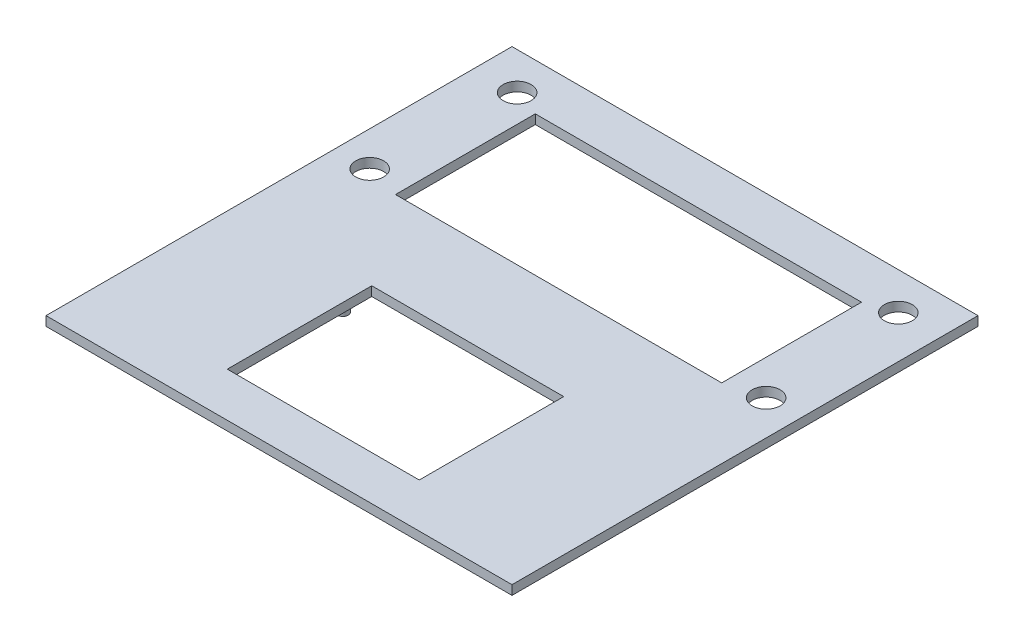
ISO-10303-21;
HEADER;
FILE_DESCRIPTION(('STEP AP214'),'2;1');
FILE_NAME('part.step','',(''),(''),'','','');
FILE_SCHEMA(('AUTOMOTIVE_DESIGN { 1 0 10303 214 1 1 1 1 }'));
ENDSEC;
DATA;
#1=APPLICATION_CONTEXT('core data for automotive mechanical design processes');
#2=APPLICATION_PROTOCOL_DEFINITION('international standard','automotive_design',2000,#1);
#3=PRODUCT_CONTEXT('',#1,'mechanical');
#4=PRODUCT('Part','Part','',(#3));
#5=PRODUCT_RELATED_PRODUCT_CATEGORY('part','',(#4));
#6=PRODUCT_DEFINITION_FORMATION('','',#4);
#7=PRODUCT_DEFINITION_CONTEXT('part definition',#1,'design');
#8=PRODUCT_DEFINITION('design','',#6,#7);
#9=PRODUCT_DEFINITION_SHAPE('','',#8);
#10=(LENGTH_UNIT() NAMED_UNIT(*) SI_UNIT(.MILLI.,.METRE.));
#11=(NAMED_UNIT(*) PLANE_ANGLE_UNIT() SI_UNIT($,.RADIAN.));
#12=(NAMED_UNIT(*) SI_UNIT($,.STERADIAN.) SOLID_ANGLE_UNIT());
#13=UNCERTAINTY_MEASURE_WITH_UNIT(LENGTH_MEASURE(1.E-05),#10,'distance_accuracy_value','');
#14=(GEOMETRIC_REPRESENTATION_CONTEXT(3) GLOBAL_UNCERTAINTY_ASSIGNED_CONTEXT((#13)) GLOBAL_UNIT_ASSIGNED_CONTEXT((#10,
#11,#12)) REPRESENTATION_CONTEXT('',''));
#15=CARTESIAN_POINT('',(0.,0.,0.));
#16=DIRECTION('',(0.,0.,1.));
#17=DIRECTION('',(1.,0.,0.));
#18=AXIS2_PLACEMENT_3D('',#15,#16,#17);
#19=CARTESIAN_POINT('',(0.,1.27,0.));
#20=DIRECTION('',(0.,1.,0.));
#21=DIRECTION('',(0.,0.,1.));
#22=AXIS2_PLACEMENT_3D('',#19,#20,#21);
#23=PLANE('',#22);
#24=DIRECTION('',(0.,0.,1.));
#25=VECTOR('',#24,1.);
#26=CARTESIAN_POINT('',(-13.081,1.27,25.7175));
#27=LINE('',#26,#25);
#28=CARTESIAN_POINT('',(-13.081,1.27,6.0325));
#29=VERTEX_POINT('',#28);
#30=CARTESIAN_POINT('',(-13.081,1.27,25.7175));
#31=VERTEX_POINT('',#30);
#32=EDGE_CURVE('E52',#29,#31,#27,.T.);
#33=ORIENTED_EDGE('',*,*,#32,.F.);
#34=DIRECTION('',(-1.,0.,0.));
#35=VECTOR('',#34,1.);
#36=CARTESIAN_POINT('',(13.081,1.27,6.03249999999999));
#37=LINE('',#36,#35);
#38=CARTESIAN_POINT('',(13.081,1.27,6.03249999999999));
#39=VERTEX_POINT('',#38);
#40=EDGE_CURVE('E134',#39,#29,#37,.T.);
#41=ORIENTED_EDGE('',*,*,#40,.F.);
#42=DIRECTION('',(0.,0.,-1.));
#43=VECTOR('',#42,1.);
#44=CARTESIAN_POINT('',(13.081,1.27,25.7175));
#45=LINE('',#44,#43);
#46=CARTESIAN_POINT('',(13.081,1.27,25.7175));
#47=VERTEX_POINT('',#46);
#48=EDGE_CURVE('E154',#47,#39,#45,.T.);
#49=ORIENTED_EDGE('',*,*,#48,.F.);
#50=DIRECTION('',(1.,0.,0.));
#51=VECTOR('',#50,1.);
#52=CARTESIAN_POINT('',(13.081,1.27,25.7175));
#53=LINE('',#52,#51);
#54=EDGE_CURVE('E148',#31,#47,#53,.T.);
#55=ORIENTED_EDGE('',*,*,#54,.F.);
#56=EDGE_LOOP('',(#33,#41,#49,#55));
#57=FACE_BOUND('',#56,.T.);
#58=DIRECTION('',(0.,0.,1.));
#59=VECTOR('',#58,1.);
#60=CARTESIAN_POINT('',(-22.225,1.27,-6.35));
#61=LINE('',#60,#59);
#62=CARTESIAN_POINT('',(-22.225,1.27,-25.4));
#63=VERTEX_POINT('',#62);
#64=CARTESIAN_POINT('',(-22.225,1.27,-6.35));
#65=VERTEX_POINT('',#64);
#66=EDGE_CURVE('E183',#63,#65,#61,.T.);
#67=ORIENTED_EDGE('',*,*,#66,.F.);
#68=DIRECTION('',(-1.,0.,0.));
#69=VECTOR('',#68,1.);
#70=CARTESIAN_POINT('',(22.225,1.27,-25.4));
#71=LINE('',#70,#69);
#72=CARTESIAN_POINT('',(22.225,1.27,-25.4));
#73=VERTEX_POINT('',#72);
#74=EDGE_CURVE('E173',#73,#63,#71,.T.);
#75=ORIENTED_EDGE('',*,*,#74,.F.);
#76=DIRECTION('',(0.,0.,-1.));
#77=VECTOR('',#76,1.);
#78=CARTESIAN_POINT('',(22.225,1.27,-6.35000000000001));
#79=LINE('',#78,#77);
#80=CARTESIAN_POINT('',(22.225,1.27,-6.35000000000001));
#81=VERTEX_POINT('',#80);
#82=EDGE_CURVE('E188',#81,#73,#79,.T.);
#83=ORIENTED_EDGE('',*,*,#82,.F.);
#84=DIRECTION('',(1.,0.,0.));
#85=VECTOR('',#84,1.);
#86=CARTESIAN_POINT('',(22.225,1.27,-6.35000000000001));
#87=LINE('',#86,#85);
#88=EDGE_CURVE('E185',#65,#81,#87,.T.);
#89=ORIENTED_EDGE('',*,*,#88,.F.);
#90=EDGE_LOOP('',(#67,#75,#83,#89));
#91=FACE_BOUND('',#90,.T.);
#92=CARTESIAN_POINT('',(-25.9715,1.27,-26.67));
#93=DIRECTION('',(0.,1.,0.));
#94=DIRECTION('',(0.,0.,1.));
#95=AXIS2_PLACEMENT_3D('',#92,#93,#94);
#96=CIRCLE('',#95,1.905);
#97=CARTESIAN_POINT('',(-25.9715,1.27,-24.765));
#98=VERTEX_POINT('',#97);
#99=EDGE_CURVE('E202',#98,#98,#96,.T.);
#100=ORIENTED_EDGE('',*,*,#99,.F.);
#101=EDGE_LOOP('',(#100));
#102=FACE_BOUND('',#101,.T.);
#103=CARTESIAN_POINT('',(-27.0129,1.27,-7.62));
#104=DIRECTION('',(0.,1.,0.));
#105=DIRECTION('',(0.,0.,1.));
#106=AXIS2_PLACEMENT_3D('',#103,#104,#105);
#107=CIRCLE('',#106,1.905);
#108=CARTESIAN_POINT('',(-27.0129,1.27,-5.715));
#109=VERTEX_POINT('',#108);
#110=EDGE_CURVE('E208',#109,#109,#107,.T.);
#111=ORIENTED_EDGE('',*,*,#110,.F.);
#112=EDGE_LOOP('',(#111));
#113=FACE_BOUND('',#112,.T.);
#114=CARTESIAN_POINT('',(27.0129,1.27,-7.62000000000001));
#115=DIRECTION('',(0.,1.,0.));
#116=DIRECTION('',(0.,0.,1.));
#117=AXIS2_PLACEMENT_3D('',#114,#115,#116);
#118=CIRCLE('',#117,1.905);
#119=CARTESIAN_POINT('',(27.0129,1.27,-5.71500000000001));
#120=VERTEX_POINT('',#119);
#121=EDGE_CURVE('E217',#120,#120,#118,.F.);
#122=ORIENTED_EDGE('',*,*,#121,.T.);
#123=EDGE_LOOP('',(#122));
#124=FACE_BOUND('',#123,.T.);
#125=DIRECTION('',(0.,0.,1.));
#126=VECTOR('',#125,1.);
#127=CARTESIAN_POINT('',(-31.75,1.27,31.75));
#128=LINE('',#127,#126);
#129=CARTESIAN_POINT('',(-31.75,1.27,-31.75));
#130=VERTEX_POINT('',#129);
#131=CARTESIAN_POINT('',(-31.75,1.27,31.75));
#132=VERTEX_POINT('',#131);
#133=EDGE_CURVE('E226',#130,#132,#128,.T.);
#134=ORIENTED_EDGE('',*,*,#133,.T.);
#135=DIRECTION('',(1.,0.,0.));
#136=VECTOR('',#135,1.);
#137=CARTESIAN_POINT('',(31.75,1.27,31.75));
#138=LINE('',#137,#136);
#139=CARTESIAN_POINT('',(31.75,1.27,31.75));
#140=VERTEX_POINT('',#139);
#141=EDGE_CURVE('E229',#132,#140,#138,.T.);
#142=ORIENTED_EDGE('',*,*,#141,.T.);
#143=DIRECTION('',(0.,0.,-1.));
#144=VECTOR('',#143,1.);
#145=CARTESIAN_POINT('',(31.75,1.27,31.75));
#146=LINE('',#145,#144);
#147=CARTESIAN_POINT('',(31.75,1.27,-31.75));
#148=VERTEX_POINT('',#147);
#149=EDGE_CURVE('E232',#140,#148,#146,.T.);
#150=ORIENTED_EDGE('',*,*,#149,.T.);
#151=DIRECTION('',(-1.,0.,0.));
#152=VECTOR('',#151,1.);
#153=CARTESIAN_POINT('',(31.75,1.27,-31.75));
#154=LINE('',#153,#152);
#155=EDGE_CURVE('E234',#148,#130,#154,.T.);
#156=ORIENTED_EDGE('',*,*,#155,.T.);
#157=EDGE_LOOP('',(#134,#142,#150,#156));
#158=FACE_BOUND('',#157,.T.);
#159=CARTESIAN_POINT('',(25.9715,1.27,-26.67));
#160=DIRECTION('',(0.,1.,0.));
#161=DIRECTION('',(0.,0.,1.));
#162=AXIS2_PLACEMENT_3D('',#159,#160,#161);
#163=CIRCLE('',#162,1.905);
#164=CARTESIAN_POINT('',(25.9715,1.27,-24.765));
#165=VERTEX_POINT('',#164);
#166=EDGE_CURVE('E214',#165,#165,#163,.F.);
#167=ORIENTED_EDGE('',*,*,#166,.T.);
#168=EDGE_LOOP('',(#167));
#169=FACE_BOUND('',#168,.T.);
#170=ADVANCED_FACE('F35',(#57,#91,#102,#113,#124,#158,#169),#23,.T.);
#171=CARTESIAN_POINT('',(0.,0.,0.));
#172=DIRECTION('',(0.,1.,0.));
#173=DIRECTION('',(0.,0.,1.));
#174=AXIS2_PLACEMENT_3D('',#171,#172,#173);
#175=PLANE('',#174);
#176=DIRECTION('',(1.,0.,0.));
#177=VECTOR('',#176,1.);
#178=CARTESIAN_POINT('',(13.081,0.,6.03249999999999));
#179=LINE('',#178,#177);
#180=CARTESIAN_POINT('',(-13.081,0.,6.0325));
#181=VERTEX_POINT('',#180);
#182=CARTESIAN_POINT('',(13.081,0.,6.03249999999999));
#183=VERTEX_POINT('',#182);
#184=EDGE_CURVE('E146',#181,#183,#179,.T.);
#185=ORIENTED_EDGE('',*,*,#184,.F.);
#186=DIRECTION('',(0.,0.,-1.));
#187=VECTOR('',#186,1.);
#188=CARTESIAN_POINT('',(-13.081,0.,25.7175));
#189=LINE('',#188,#187);
#190=CARTESIAN_POINT('',(-13.081,0.,25.7175));
#191=VERTEX_POINT('',#190);
#192=EDGE_CURVE('E128',#191,#181,#189,.T.);
#193=ORIENTED_EDGE('',*,*,#192,.F.);
#194=DIRECTION('',(-1.,0.,0.));
#195=VECTOR('',#194,1.);
#196=CARTESIAN_POINT('',(13.081,0.,25.7175));
#197=LINE('',#196,#195);
#198=CARTESIAN_POINT('',(13.081,0.,25.7175));
#199=VERTEX_POINT('',#198);
#200=EDGE_CURVE('E137',#199,#191,#197,.T.);
#201=ORIENTED_EDGE('',*,*,#200,.F.);
#202=DIRECTION('',(0.,0.,1.));
#203=VECTOR('',#202,1.);
#204=CARTESIAN_POINT('',(13.081,0.,25.7175));
#205=LINE('',#204,#203);
#206=EDGE_CURVE('E60',#183,#199,#205,.T.);
#207=ORIENTED_EDGE('',*,*,#206,.F.);
#208=EDGE_LOOP('',(#185,#193,#201,#207));
#209=FACE_BOUND('',#208,.T.);
#210=CARTESIAN_POINT('',(15.748,0.,19.3167));
#211=DIRECTION('',(0.,1.,0.));
#212=DIRECTION('',(0.,0.,1.));
#213=AXIS2_PLACEMENT_3D('',#210,#211,#212);
#214=CIRCLE('',#213,0.730250000000003);
#215=CARTESIAN_POINT('',(15.748,0.,20.04695));
#216=VERTEX_POINT('',#215);
#217=EDGE_CURVE('E39',#216,#216,#214,.T.);
#218=ORIENTED_EDGE('',*,*,#217,.T.);
#219=EDGE_LOOP('',(#218));
#220=FACE_BOUND('',#219,.T.);
#221=CARTESIAN_POINT('',(-15.748,0.,7.3025));
#222=DIRECTION('',(0.,1.,0.));
#223=DIRECTION('',(0.,0.,1.));
#224=AXIS2_PLACEMENT_3D('',#221,#222,#223);
#225=CIRCLE('',#224,0.730249999999999);
#226=CARTESIAN_POINT('',(-15.748,0.,8.03275));
#227=VERTEX_POINT('',#226);
#228=EDGE_CURVE('E168',#227,#227,#225,.T.);
#229=ORIENTED_EDGE('',*,*,#228,.T.);
#230=EDGE_LOOP('',(#229));
#231=FACE_BOUND('',#230,.T.);
#232=DIRECTION('',(-1.,0.,0.));
#233=VECTOR('',#232,1.);
#234=CARTESIAN_POINT('',(22.225,0.,-25.4));
#235=LINE('',#234,#233);
#236=CARTESIAN_POINT('',(22.225,0.,-25.4));
#237=VERTEX_POINT('',#236);
#238=CARTESIAN_POINT('',(-22.225,0.,-25.4));
#239=VERTEX_POINT('',#238);
#240=EDGE_CURVE('E179',#237,#239,#235,.T.);
#241=ORIENTED_EDGE('',*,*,#240,.T.);
#242=DIRECTION('',(0.,0.,1.));
#243=VECTOR('',#242,1.);
#244=CARTESIAN_POINT('',(-22.225,0.,-6.35));
#245=LINE('',#244,#243);
#246=CARTESIAN_POINT('',(-22.225,0.,-6.35));
#247=VERTEX_POINT('',#246);
#248=EDGE_CURVE('E169',#239,#247,#245,.T.);
#249=ORIENTED_EDGE('',*,*,#248,.T.);
#250=DIRECTION('',(1.,0.,0.));
#251=VECTOR('',#250,1.);
#252=CARTESIAN_POINT('',(22.225,0.,-6.35000000000001));
#253=LINE('',#252,#251);
#254=CARTESIAN_POINT('',(22.225,0.,-6.35000000000001));
#255=VERTEX_POINT('',#254);
#256=EDGE_CURVE('E172',#247,#255,#253,.T.);
#257=ORIENTED_EDGE('',*,*,#256,.T.);
#258=DIRECTION('',(0.,0.,-1.));
#259=VECTOR('',#258,1.);
#260=CARTESIAN_POINT('',(22.225,0.,-6.35000000000001));
#261=LINE('',#260,#259);
#262=EDGE_CURVE('E176',#255,#237,#261,.T.);
#263=ORIENTED_EDGE('',*,*,#262,.T.);
#264=EDGE_LOOP('',(#241,#249,#257,#263));
#265=FACE_BOUND('',#264,.T.);
#266=CARTESIAN_POINT('',(-25.9715,0.,-26.67));
#267=DIRECTION('',(0.,1.,0.));
#268=DIRECTION('',(0.,0.,1.));
#269=AXIS2_PLACEMENT_3D('',#266,#267,#268);
#270=CIRCLE('',#269,1.905);
#271=CARTESIAN_POINT('',(-25.9715,0.,-24.765));
#272=VERTEX_POINT('',#271);
#273=EDGE_CURVE('E195',#272,#272,#270,.T.);
#274=ORIENTED_EDGE('',*,*,#273,.T.);
#275=EDGE_LOOP('',(#274));
#276=FACE_BOUND('',#275,.T.);
#277=CARTESIAN_POINT('',(-27.0129,0.,-7.62));
#278=DIRECTION('',(0.,1.,0.));
#279=DIRECTION('',(0.,0.,1.));
#280=AXIS2_PLACEMENT_3D('',#277,#278,#279);
#281=CIRCLE('',#280,1.905);
#282=CARTESIAN_POINT('',(-27.0129,0.,-5.715));
#283=VERTEX_POINT('',#282);
#284=EDGE_CURVE('E205',#283,#283,#281,.T.);
#285=ORIENTED_EDGE('',*,*,#284,.T.);
#286=EDGE_LOOP('',(#285));
#287=FACE_BOUND('',#286,.T.);
#288=CARTESIAN_POINT('',(27.0129,0.,-7.62000000000001));
#289=DIRECTION('',(0.,1.,0.));
#290=DIRECTION('',(0.,0.,1.));
#291=AXIS2_PLACEMENT_3D('',#288,#289,#290);
#292=CIRCLE('',#291,1.905);
#293=CARTESIAN_POINT('',(27.0129,0.,-5.71500000000001));
#294=VERTEX_POINT('',#293);
#295=EDGE_CURVE('E220',#294,#294,#292,.F.);
#296=ORIENTED_EDGE('',*,*,#295,.F.);
#297=EDGE_LOOP('',(#296));
#298=FACE_BOUND('',#297,.T.);
#299=DIRECTION('',(0.,0.,1.));
#300=VECTOR('',#299,1.);
#301=CARTESIAN_POINT('',(-31.75,0.,31.75));
#302=LINE('',#301,#300);
#303=CARTESIAN_POINT('',(-31.75,0.,-31.75));
#304=VERTEX_POINT('',#303);
#305=CARTESIAN_POINT('',(-31.75,0.,31.75));
#306=VERTEX_POINT('',#305);
#307=EDGE_CURVE('E223',#304,#306,#302,.T.);
#308=ORIENTED_EDGE('',*,*,#307,.F.);
#309=DIRECTION('',(-1.,0.,0.));
#310=VECTOR('',#309,1.);
#311=CARTESIAN_POINT('',(31.75,0.,-31.75));
#312=LINE('',#311,#310);
#313=CARTESIAN_POINT('',(31.75,0.,-31.75));
#314=VERTEX_POINT('',#313);
#315=EDGE_CURVE('E230',#314,#304,#312,.T.);
#316=ORIENTED_EDGE('',*,*,#315,.F.);
#317=DIRECTION('',(0.,0.,-1.));
#318=VECTOR('',#317,1.);
#319=CARTESIAN_POINT('',(31.75,0.,31.75));
#320=LINE('',#319,#318);
#321=CARTESIAN_POINT('',(31.75,0.,31.75));
#322=VERTEX_POINT('',#321);
#323=EDGE_CURVE('E241',#322,#314,#320,.T.);
#324=ORIENTED_EDGE('',*,*,#323,.F.);
#325=DIRECTION('',(1.,0.,0.));
#326=VECTOR('',#325,1.);
#327=CARTESIAN_POINT('',(31.75,0.,31.75));
#328=LINE('',#327,#326);
#329=EDGE_CURVE('E239',#306,#322,#328,.T.);
#330=ORIENTED_EDGE('',*,*,#329,.F.);
#331=EDGE_LOOP('',(#308,#316,#324,#330));
#332=FACE_BOUND('',#331,.T.);
#333=CARTESIAN_POINT('',(25.9715,0.,-26.67));
#334=DIRECTION('',(0.,1.,0.));
#335=DIRECTION('',(0.,0.,1.));
#336=AXIS2_PLACEMENT_3D('',#333,#334,#335);
#337=CIRCLE('',#336,1.905);
#338=CARTESIAN_POINT('',(25.9715,0.,-24.765));
#339=VERTEX_POINT('',#338);
#340=EDGE_CURVE('E211',#339,#339,#337,.F.);
#341=ORIENTED_EDGE('',*,*,#340,.F.);
#342=EDGE_LOOP('',(#341));
#343=FACE_BOUND('',#342,.T.);
#344=ADVANCED_FACE('F143',(#209,#220,#231,#265,#276,#287,#298,#332,#343),#175,.F.);
#345=CARTESIAN_POINT('',(-31.75,1.27,31.75));
#346=DIRECTION('',(1.,0.,0.));
#347=DIRECTION('',(0.,0.,-1.));
#348=AXIS2_PLACEMENT_3D('',#345,#346,#347);
#349=PLANE('',#348);
#350=ORIENTED_EDGE('',*,*,#307,.T.);
#351=DIRECTION('',(0.,-1.,0.));
#352=VECTOR('',#351,1.);
#353=CARTESIAN_POINT('',(-31.75,1.27,31.75));
#354=LINE('',#353,#352);
#355=EDGE_CURVE('E11',#132,#306,#354,.T.);
#356=ORIENTED_EDGE('',*,*,#355,.F.);
#357=ORIENTED_EDGE('',*,*,#133,.F.);
#358=DIRECTION('',(0.,-1.,0.));
#359=VECTOR('',#358,1.);
#360=CARTESIAN_POINT('',(-31.75,1.27,-31.75));
#361=LINE('',#360,#359);
#362=EDGE_CURVE('E236',#130,#304,#361,.T.);
#363=ORIENTED_EDGE('',*,*,#362,.T.);
#364=EDGE_LOOP('',(#350,#356,#357,#363));
#365=FACE_BOUND('',#364,.T.);
#366=ADVANCED_FACE('F37',(#365),#349,.F.);
#367=CARTESIAN_POINT('',(31.75,1.27,31.75));
#368=DIRECTION('',(0.,0.,-1.));
#369=DIRECTION('',(-1.,0.,0.));
#370=AXIS2_PLACEMENT_3D('',#367,#368,#369);
#371=PLANE('',#370);
#372=ORIENTED_EDGE('',*,*,#329,.T.);
#373=DIRECTION('',(0.,-1.,0.));
#374=VECTOR('',#373,1.);
#375=CARTESIAN_POINT('',(31.75,1.27,31.75));
#376=LINE('',#375,#374);
#377=EDGE_CURVE('E44',#140,#322,#376,.T.);
#378=ORIENTED_EDGE('',*,*,#377,.F.);
#379=ORIENTED_EDGE('',*,*,#141,.F.);
#380=ORIENTED_EDGE('',*,*,#355,.T.);
#381=EDGE_LOOP('',(#372,#378,#379,#380));
#382=FACE_BOUND('',#381,.T.);
#383=ADVANCED_FACE('F290',(#382),#371,.F.);
#384=CARTESIAN_POINT('',(31.75,1.27,31.75));
#385=DIRECTION('',(-1.,0.,0.));
#386=DIRECTION('',(0.,0.,1.));
#387=AXIS2_PLACEMENT_3D('',#384,#385,#386);
#388=PLANE('',#387);
#389=ORIENTED_EDGE('',*,*,#323,.T.);
#390=DIRECTION('',(0.,-1.,0.));
#391=VECTOR('',#390,1.);
#392=CARTESIAN_POINT('',(31.75,1.27,-31.75));
#393=LINE('',#392,#391);
#394=EDGE_CURVE('E246',#148,#314,#393,.T.);
#395=ORIENTED_EDGE('',*,*,#394,.F.);
#396=ORIENTED_EDGE('',*,*,#149,.F.);
#397=ORIENTED_EDGE('',*,*,#377,.T.);
#398=EDGE_LOOP('',(#389,#395,#396,#397));
#399=FACE_BOUND('',#398,.T.);
#400=ADVANCED_FACE('F287',(#399),#388,.F.);
#401=CARTESIAN_POINT('',(31.75,1.27,-31.75));
#402=DIRECTION('',(0.,0.,1.));
#403=DIRECTION('',(1.,0.,0.));
#404=AXIS2_PLACEMENT_3D('',#401,#402,#403);
#405=PLANE('',#404);
#406=ORIENTED_EDGE('',*,*,#315,.T.);
#407=ORIENTED_EDGE('',*,*,#362,.F.);
#408=ORIENTED_EDGE('',*,*,#155,.F.);
#409=ORIENTED_EDGE('',*,*,#394,.T.);
#410=EDGE_LOOP('',(#406,#407,#408,#409));
#411=FACE_BOUND('',#410,.T.);
#412=ADVANCED_FACE('F284',(#411),#405,.F.);
#413=CARTESIAN_POINT('',(27.0129,0.,-7.62000000000001));
#414=DIRECTION('',(0.,1.,0.));
#415=DIRECTION('',(0.,0.,1.));
#416=AXIS2_PLACEMENT_3D('',#413,#414,#415);
#417=CYLINDRICAL_SURFACE('',#416,1.905);
#418=ORIENTED_EDGE('',*,*,#295,.T.);
#419=EDGE_LOOP('',(#418));
#420=FACE_BOUND('',#419,.T.);
#421=ORIENTED_EDGE('',*,*,#121,.F.);
#422=EDGE_LOOP('',(#421));
#423=FACE_BOUND('',#422,.T.);
#424=ADVANCED_FACE('F281',(#420,#423),#417,.F.);
#425=CARTESIAN_POINT('',(25.9715,0.,-26.67));
#426=DIRECTION('',(0.,1.,0.));
#427=DIRECTION('',(0.,0.,1.));
#428=AXIS2_PLACEMENT_3D('',#425,#426,#427);
#429=CYLINDRICAL_SURFACE('',#428,1.905);
#430=ORIENTED_EDGE('',*,*,#340,.T.);
#431=EDGE_LOOP('',(#430));
#432=FACE_BOUND('',#431,.T.);
#433=ORIENTED_EDGE('',*,*,#166,.F.);
#434=EDGE_LOOP('',(#433));
#435=FACE_BOUND('',#434,.T.);
#436=ADVANCED_FACE('F314',(#432,#435),#429,.F.);
#437=CARTESIAN_POINT('',(-27.0129,0.,-7.62));
#438=DIRECTION('',(0.,1.,0.));
#439=DIRECTION('',(0.,0.,1.));
#440=AXIS2_PLACEMENT_3D('',#437,#438,#439);
#441=CYLINDRICAL_SURFACE('',#440,1.905);
#442=ORIENTED_EDGE('',*,*,#284,.F.);
#443=EDGE_LOOP('',(#442));
#444=FACE_BOUND('',#443,.T.);
#445=ORIENTED_EDGE('',*,*,#110,.T.);
#446=EDGE_LOOP('',(#445));
#447=FACE_BOUND('',#446,.T.);
#448=ADVANCED_FACE('F316',(#444,#447),#441,.F.);
#449=CARTESIAN_POINT('',(-25.9715,0.,-26.67));
#450=DIRECTION('',(0.,1.,0.));
#451=DIRECTION('',(0.,0.,1.));
#452=AXIS2_PLACEMENT_3D('',#449,#450,#451);
#453=CYLINDRICAL_SURFACE('',#452,1.905);
#454=ORIENTED_EDGE('',*,*,#273,.F.);
#455=EDGE_LOOP('',(#454));
#456=FACE_BOUND('',#455,.T.);
#457=ORIENTED_EDGE('',*,*,#99,.T.);
#458=EDGE_LOOP('',(#457));
#459=FACE_BOUND('',#458,.T.);
#460=ADVANCED_FACE('F322',(#456,#459),#453,.F.);
#461=CARTESIAN_POINT('',(-22.225,0.,-6.35));
#462=DIRECTION('',(-1.,0.,0.));
#463=DIRECTION('',(0.,0.,1.));
#464=AXIS2_PLACEMENT_3D('',#461,#462,#463);
#465=PLANE('',#464);
#466=ORIENTED_EDGE('',*,*,#66,.T.);
#467=DIRECTION('',(0.,1.,0.));
#468=VECTOR('',#467,1.);
#469=CARTESIAN_POINT('',(-22.225,0.,-6.35));
#470=LINE('',#469,#468);
#471=EDGE_CURVE('E182',#247,#65,#470,.T.);
#472=ORIENTED_EDGE('',*,*,#471,.F.);
#473=ORIENTED_EDGE('',*,*,#248,.F.);
#474=DIRECTION('',(0.,1.,0.));
#475=VECTOR('',#474,1.);
#476=CARTESIAN_POINT('',(-22.225,0.,-25.4));
#477=LINE('',#476,#475);
#478=EDGE_CURVE('E193',#239,#63,#477,.T.);
#479=ORIENTED_EDGE('',*,*,#478,.T.);
#480=EDGE_LOOP('',(#466,#472,#473,#479));
#481=FACE_BOUND('',#480,.T.);
#482=ADVANCED_FACE('F329',(#481),#465,.F.);
#483=CARTESIAN_POINT('',(22.225,0.,-25.4));
#484=DIRECTION('',(0.,0.,-1.));
#485=DIRECTION('',(-1.,0.,0.));
#486=AXIS2_PLACEMENT_3D('',#483,#484,#485);
#487=PLANE('',#486);
#488=ORIENTED_EDGE('',*,*,#74,.T.);
#489=ORIENTED_EDGE('',*,*,#478,.F.);
#490=ORIENTED_EDGE('',*,*,#240,.F.);
#491=DIRECTION('',(0.,1.,0.));
#492=VECTOR('',#491,1.);
#493=CARTESIAN_POINT('',(22.225,0.,-25.4));
#494=LINE('',#493,#492);
#495=EDGE_CURVE('E196',#237,#73,#494,.T.);
#496=ORIENTED_EDGE('',*,*,#495,.T.);
#497=EDGE_LOOP('',(#488,#489,#490,#496));
#498=FACE_BOUND('',#497,.T.);
#499=ADVANCED_FACE('F332',(#498),#487,.F.);
#500=CARTESIAN_POINT('',(22.225,0.,-6.35000000000001));
#501=DIRECTION('',(1.,0.,0.));
#502=DIRECTION('',(0.,0.,-1.));
#503=AXIS2_PLACEMENT_3D('',#500,#501,#502);
#504=PLANE('',#503);
#505=ORIENTED_EDGE('',*,*,#82,.T.);
#506=ORIENTED_EDGE('',*,*,#495,.F.);
#507=ORIENTED_EDGE('',*,*,#262,.F.);
#508=DIRECTION('',(0.,1.,0.));
#509=VECTOR('',#508,1.);
#510=CARTESIAN_POINT('',(22.225,0.,-6.35000000000001));
#511=LINE('',#510,#509);
#512=EDGE_CURVE('E198',#255,#81,#511,.T.);
#513=ORIENTED_EDGE('',*,*,#512,.T.);
#514=EDGE_LOOP('',(#505,#506,#507,#513));
#515=FACE_BOUND('',#514,.T.);
#516=ADVANCED_FACE('F268',(#515),#504,.F.);
#517=CARTESIAN_POINT('',(22.225,0.,-6.35000000000001));
#518=DIRECTION('',(0.,0.,1.));
#519=DIRECTION('',(1.,0.,0.));
#520=AXIS2_PLACEMENT_3D('',#517,#518,#519);
#521=PLANE('',#520);
#522=ORIENTED_EDGE('',*,*,#88,.T.);
#523=ORIENTED_EDGE('',*,*,#512,.F.);
#524=ORIENTED_EDGE('',*,*,#256,.F.);
#525=ORIENTED_EDGE('',*,*,#471,.T.);
#526=EDGE_LOOP('',(#522,#523,#524,#525));
#527=FACE_BOUND('',#526,.T.);
#528=ADVANCED_FACE('F258',(#527),#521,.F.);
#529=CARTESIAN_POINT('',(-15.748,-2.54,7.3025));
#530=DIRECTION('',(0.,1.,0.));
#531=DIRECTION('',(0.,0.,1.));
#532=AXIS2_PLACEMENT_3D('',#529,#530,#531);
#533=CYLINDRICAL_SURFACE('',#532,0.730249999999999);
#534=CARTESIAN_POINT('',(-15.748,-2.54,7.3025));
#535=DIRECTION('',(0.,1.,0.));
#536=DIRECTION('',(0.,0.,1.));
#537=AXIS2_PLACEMENT_3D('',#534,#535,#536);
#538=CIRCLE('',#537,0.730249999999999);
#539=CARTESIAN_POINT('',(-15.748,-2.54,8.03275));
#540=VERTEX_POINT('',#539);
#541=EDGE_CURVE('E165',#540,#540,#538,.T.);
#542=ORIENTED_EDGE('',*,*,#541,.T.);
#543=EDGE_LOOP('',(#542));
#544=FACE_BOUND('',#543,.T.);
#545=ORIENTED_EDGE('',*,*,#228,.F.);
#546=EDGE_LOOP('',(#545));
#547=FACE_BOUND('',#546,.T.);
#548=ADVANCED_FACE('F255',(#544,#547),#533,.T.);
#549=CARTESIAN_POINT('',(-15.748,-2.54,7.3025));
#550=DIRECTION('',(0.,1.,0.));
#551=DIRECTION('',(0.,0.,1.));
#552=AXIS2_PLACEMENT_3D('',#549,#550,#551);
#553=PLANE('',#552);
#554=ORIENTED_EDGE('',*,*,#541,.F.);
#555=EDGE_LOOP('',(#554));
#556=FACE_BOUND('',#555,.T.);
#557=ADVANCED_FACE('F257',(#556),#553,.F.);
#558=CARTESIAN_POINT('',(15.748,-2.54,19.3167));
#559=DIRECTION('',(0.,1.,0.));
#560=DIRECTION('',(0.,0.,1.));
#561=AXIS2_PLACEMENT_3D('',#558,#559,#560);
#562=CYLINDRICAL_SURFACE('',#561,0.730250000000003);
#563=CARTESIAN_POINT('',(15.748,-2.54,19.3167));
#564=DIRECTION('',(0.,1.,0.));
#565=DIRECTION('',(0.,0.,1.));
#566=AXIS2_PLACEMENT_3D('',#563,#564,#565);
#567=CIRCLE('',#566,0.730250000000003);
#568=CARTESIAN_POINT('',(15.748,-2.54,20.04695));
#569=VERTEX_POINT('',#568);
#570=EDGE_CURVE('E140',#569,#569,#567,.T.);
#571=ORIENTED_EDGE('',*,*,#570,.T.);
#572=EDGE_LOOP('',(#571));
#573=FACE_BOUND('',#572,.T.);
#574=ORIENTED_EDGE('',*,*,#217,.F.);
#575=EDGE_LOOP('',(#574));
#576=FACE_BOUND('',#575,.T.);
#577=ADVANCED_FACE('F265',(#573,#576),#562,.T.);
#578=CARTESIAN_POINT('',(15.748,-2.54,19.3167));
#579=DIRECTION('',(0.,1.,0.));
#580=DIRECTION('',(0.,0.,1.));
#581=AXIS2_PLACEMENT_3D('',#578,#579,#580);
#582=PLANE('',#581);
#583=ORIENTED_EDGE('',*,*,#570,.F.);
#584=EDGE_LOOP('',(#583));
#585=FACE_BOUND('',#584,.T.);
#586=ADVANCED_FACE('F393',(#585),#582,.F.);
#587=CARTESIAN_POINT('',(-13.081,-2.541,25.7175));
#588=DIRECTION('',(-1.,0.,0.));
#589=DIRECTION('',(0.,0.,1.));
#590=AXIS2_PLACEMENT_3D('',#587,#588,#589);
#591=PLANE('',#590);
#592=ORIENTED_EDGE('',*,*,#192,.T.);
#593=DIRECTION('',(0.,1.,0.));
#594=VECTOR('',#593,1.);
#595=CARTESIAN_POINT('',(-13.081,-2.541,6.0325));
#596=LINE('',#595,#594);
#597=EDGE_CURVE('E141',#181,#29,#596,.T.);
#598=ORIENTED_EDGE('',*,*,#597,.T.);
#599=ORIENTED_EDGE('',*,*,#32,.T.);
#600=DIRECTION('',(0.,1.,0.));
#601=VECTOR('',#600,1.);
#602=CARTESIAN_POINT('',(-13.081,-2.541,25.7175));
#603=LINE('',#602,#601);
#604=EDGE_CURVE('E124',#191,#31,#603,.T.);
#605=ORIENTED_EDGE('',*,*,#604,.F.);
#606=EDGE_LOOP('',(#592,#598,#599,#605));
#607=FACE_BOUND('',#606,.T.);
#608=ADVANCED_FACE('F126',(#607),#591,.F.);
#609=CARTESIAN_POINT('',(13.081,-2.541,6.03249999999999));
#610=DIRECTION('',(0.,0.,-1.));
#611=DIRECTION('',(-1.,0.,0.));
#612=AXIS2_PLACEMENT_3D('',#609,#610,#611);
#613=PLANE('',#612);
#614=ORIENTED_EDGE('',*,*,#184,.T.);
#615=DIRECTION('',(0.,1.,0.));
#616=VECTOR('',#615,1.);
#617=CARTESIAN_POINT('',(13.081,-2.541,6.03249999999999));
#618=LINE('',#617,#616);
#619=EDGE_CURVE('E160',#183,#39,#618,.T.);
#620=ORIENTED_EDGE('',*,*,#619,.T.);
#621=ORIENTED_EDGE('',*,*,#40,.T.);
#622=ORIENTED_EDGE('',*,*,#597,.F.);
#623=EDGE_LOOP('',(#614,#620,#621,#622));
#624=FACE_BOUND('',#623,.T.);
#625=ADVANCED_FACE('F424',(#624),#613,.F.);
#626=CARTESIAN_POINT('',(13.081,-2.541,25.7175));
#627=DIRECTION('',(1.,0.,0.));
#628=DIRECTION('',(0.,0.,-1.));
#629=AXIS2_PLACEMENT_3D('',#626,#627,#628);
#630=PLANE('',#629);
#631=ORIENTED_EDGE('',*,*,#206,.T.);
#632=DIRECTION('',(0.,1.,0.));
#633=VECTOR('',#632,1.);
#634=CARTESIAN_POINT('',(13.081,-2.541,25.7175));
#635=LINE('',#634,#633);
#636=EDGE_CURVE('E133',#199,#47,#635,.T.);
#637=ORIENTED_EDGE('',*,*,#636,.T.);
#638=ORIENTED_EDGE('',*,*,#48,.T.);
#639=ORIENTED_EDGE('',*,*,#619,.F.);
#640=EDGE_LOOP('',(#631,#637,#638,#639));
#641=FACE_BOUND('',#640,.T.);
#642=ADVANCED_FACE('F433',(#641),#630,.F.);
#643=CARTESIAN_POINT('',(13.081,-2.541,25.7175));
#644=DIRECTION('',(0.,0.,1.));
#645=DIRECTION('',(1.,0.,0.));
#646=AXIS2_PLACEMENT_3D('',#643,#644,#645);
#647=PLANE('',#646);
#648=ORIENTED_EDGE('',*,*,#200,.T.);
#649=ORIENTED_EDGE('',*,*,#604,.T.);
#650=ORIENTED_EDGE('',*,*,#54,.T.);
#651=ORIENTED_EDGE('',*,*,#636,.F.);
#652=EDGE_LOOP('',(#648,#649,#650,#651));
#653=FACE_BOUND('',#652,.T.);
#654=ADVANCED_FACE('F138',(#653),#647,.F.);
#655=CLOSED_SHELL('',(#170,#344,#366,#383,#400,#412,#424,#436,#448,#460,#482,#499,#516,#528,
#548,#557,#577,#586,#608,#625,#642,#654));
#656=MANIFOLD_SOLID_BREP('B2',#655);
#657=ADVANCED_BREP_SHAPE_REPRESENTATION('',(#18,#656),#14);
#658=SHAPE_DEFINITION_REPRESENTATION(#9,#657);
ENDSEC;
END-ISO-10303-21;
